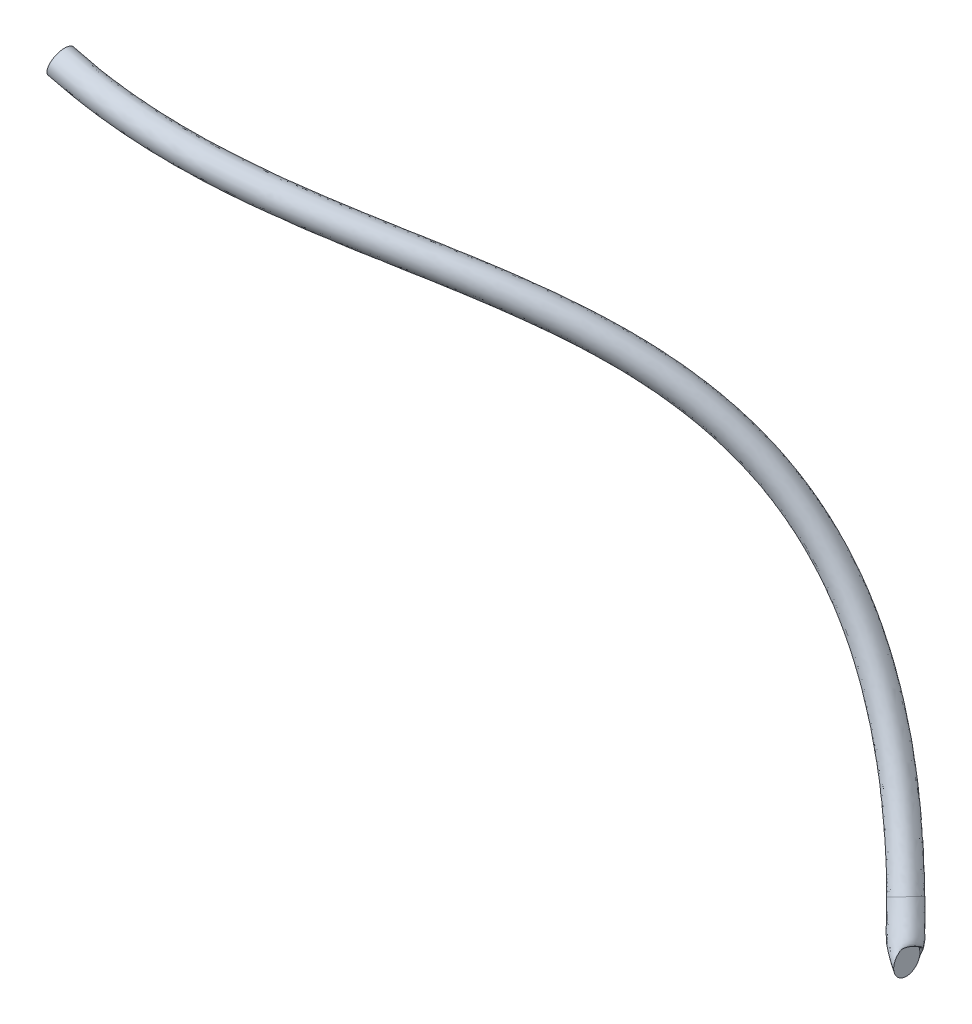
ISO-10303-21;
HEADER;
FILE_DESCRIPTION(('STEP AP214'),'2;1');
FILE_NAME('part.step','',(''),(''),'','','');
FILE_SCHEMA(('AUTOMOTIVE_DESIGN { 1 0 10303 214 1 1 1 1 }'));
ENDSEC;
DATA;
#1=APPLICATION_CONTEXT('core data for automotive mechanical design processes');
#2=APPLICATION_PROTOCOL_DEFINITION('international standard','automotive_design',2000,#1);
#3=PRODUCT_CONTEXT('',#1,'mechanical');
#4=PRODUCT('Part','Part','',(#3));
#5=PRODUCT_RELATED_PRODUCT_CATEGORY('part','',(#4));
#6=PRODUCT_DEFINITION_FORMATION('','',#4);
#7=PRODUCT_DEFINITION_CONTEXT('part definition',#1,'design');
#8=PRODUCT_DEFINITION('design','',#6,#7);
#9=PRODUCT_DEFINITION_SHAPE('','',#8);
#10=(LENGTH_UNIT() NAMED_UNIT(*) SI_UNIT(.MILLI.,.METRE.));
#11=(NAMED_UNIT(*) PLANE_ANGLE_UNIT() SI_UNIT($,.RADIAN.));
#12=(NAMED_UNIT(*) SI_UNIT($,.STERADIAN.) SOLID_ANGLE_UNIT());
#13=UNCERTAINTY_MEASURE_WITH_UNIT(LENGTH_MEASURE(1.E-05),#10,'distance_accuracy_value','');
#14=(GEOMETRIC_REPRESENTATION_CONTEXT(3) GLOBAL_UNCERTAINTY_ASSIGNED_CONTEXT((#13)) GLOBAL_UNIT_ASSIGNED_CONTEXT((#10,
#11,#12)) REPRESENTATION_CONTEXT('',''));
#15=CARTESIAN_POINT('',(0.,0.,0.));
#16=DIRECTION('',(0.,0.,1.));
#17=DIRECTION('',(1.,0.,0.));
#18=AXIS2_PLACEMENT_3D('',#15,#16,#17);
#19=CARTESIAN_POINT('',(446.882833283141,-59.1387044595043,37.8558931334681));
#20=DIRECTION('',(0.999655289938559,0.,-0.0262545481365729));
#21=DIRECTION('',(-0.0172478279121298,0.753937382114558,-0.65671983088876));
#22=AXIS2_PLACEMENT_3D('',#19,#20,#21);
#23=PLANE('',#22);
#24=CARTESIAN_POINT('',(446.839023800244,-57.2237035089334,36.1878247630106));
#25=CARTESIAN_POINT('',(446.825861185545,-57.66055337367,35.6866515055532));
#26=CARTESIAN_POINT('',(446.817501107649,-58.301098772051,35.3683372824512));
#27=CARTESIAN_POINT('',(446.815106393101,-59.6279081963031,35.2771573065552));
#28=CARTESIAN_POINT('',(446.8210865027,-60.3060019516946,35.5048530247995));
#29=CARTESIAN_POINT('',(446.844025094304,-61.3086941046831,36.3782515811853));
#30=CARTESIAN_POINT('',(446.8608423243,-61.6271180917372,37.0185761771227));
#31=CARTESIAN_POINT('',(446.895677106197,-61.7183295091265,38.3449282368166));
#32=CARTESIAN_POINT('',(446.913480151339,-61.4905552748118,39.022788246468));
#33=CARTESIAN_POINT('',(446.939805380736,-60.6168555453387,40.0251347613829));
#34=CARTESIAN_POINT('',(446.948165458632,-59.9763101469576,40.3434489844849));
#35=CARTESIAN_POINT('',(446.95056017318,-58.6495007227055,40.434628960381));
#36=CARTESIAN_POINT('',(446.944580063581,-57.971406967314,40.2069332421366));
#37=CARTESIAN_POINT('',(446.921641471977,-56.9687148143255,39.3335346857509));
#38=CARTESIAN_POINT('',(446.904824241981,-56.6502908272714,38.6932100898134));
#39=CARTESIAN_POINT('',(446.869989460084,-56.5590794098821,37.3668580301195));
#40=CARTESIAN_POINT('',(446.852186414942,-56.7868536441968,36.6889980204681));
#41=CARTESIAN_POINT('',(446.839023800244,-57.2237035089334,36.1878247630106));
#42=B_SPLINE_CURVE_WITH_KNOTS('',3,(#24,#25,#26,#27,#28,#29,#30,#31,#32,#33,#34,#35,#36,#37,#38,
#39,#40,#41),.UNSPECIFIED.,.T.,.F.,(4,2,2,2,2,2,2,2,4),(0.,0.125,0.25,0.375,0.5,0.625,0.75,
0.875,1.),.UNSPECIFIED.);
#43=CARTESIAN_POINT('',(446.839023800244,-57.2237035089334,36.1878247630106));
#44=VERTEX_POINT('',#43);
#45=EDGE_CURVE('E55',#44,#44,#42,.T.);
#46=ORIENTED_EDGE('',*,*,#45,.F.);
#47=EDGE_LOOP('',(#46));
#48=FACE_BOUND('',#47,.T.);
#49=ADVANCED_FACE('F41',(#48),#23,.T.);
#50=CARTESIAN_POINT('',(321.343126633635,41.8502568807353,71.7549999999999));
#51=DIRECTION('',(0.963586759353853,-0.267357445606727,-0.00453359422391789));
#52=DIRECTION('',(0.267360193211581,0.963596662035453,0.));
#53=AXIS2_PLACEMENT_3D('',#50,#51,#52);
#54=PLANE('',#53);
#55=CARTESIAN_POINT('',(322.022221524392,44.2977924023053,71.7549999999999));
#56=CARTESIAN_POINT('',(322.025126485193,44.2969863898816,72.4199636112474));
#57=CARTESIAN_POINT('',(321.954825398612,44.032406859063,73.0808324878151));
#58=CARTESIAN_POINT('',(321.707505374947,43.1250908345853,74.0212330453259));
#59=CARTESIAN_POINT('',(321.532009393196,42.4879414412247,74.2949738969506));
#60=CARTESIAN_POINT('',(321.17643613988,41.2064148388973,74.2949738969506));
#61=CARTESIAN_POINT('',(320.998548428928,40.5699290563677,74.0212330453259));
#62=CARTESIAN_POINT('',(320.743011935337,39.664892779292,73.0808324878151));
#63=CARTESIAN_POINT('',(320.666936703679,39.4019153467415,72.4199636112474));
#64=CARTESIAN_POINT('',(320.661126782076,39.4035273715889,71.0900363887525));
#65=CARTESIAN_POINT('',(320.731427868658,39.6681069024075,70.4291675121847));
#66=CARTESIAN_POINT('',(320.978747892323,40.5754229268852,69.4887669546739));
#67=CARTESIAN_POINT('',(321.154243874074,41.2125723202458,69.2150261030493));
#68=CARTESIAN_POINT('',(321.509817127389,42.4940989225732,69.2150261030493));
#69=CARTESIAN_POINT('',(321.687704838342,43.1305847051028,69.4887669546739));
#70=CARTESIAN_POINT('',(321.943241331933,44.0356209821785,70.4291675121847));
#71=CARTESIAN_POINT('',(322.019316563591,44.298598414729,71.0900363887525));
#72=CARTESIAN_POINT('',(322.022221524392,44.2977924023053,71.7549999999999));
#73=B_SPLINE_CURVE_WITH_KNOTS('',3,(#55,#56,#57,#58,#59,#60,#61,#62,#63,#64,#65,#66,#67,#68,#69,
#70,#71,#72),.UNSPECIFIED.,.T.,.F.,(4,2,2,2,2,2,2,2,4),(0.,0.125,0.25,0.375,0.5,0.625,0.75,
0.875,1.),.UNSPECIFIED.);
#74=CARTESIAN_POINT('',(322.022221524392,44.2977924023053,71.7549999999999));
#75=VERTEX_POINT('',#74);
#76=EDGE_CURVE('E11',#75,#75,#73,.T.);
#77=ORIENTED_EDGE('',*,*,#76,.F.);
#78=EDGE_LOOP('',(#77));
#79=FACE_BOUND('',#78,.T.);
#80=ADVANCED_FACE('F92',(#79),#54,.F.);
#81=CARTESIAN_POINT('',(445.388070627803,-51.5581880827869,33.6142165685252));
#82=CARTESIAN_POINT('',(446.409694618406,-53.605028329331,34.6008385665057));
#83=CARTESIAN_POINT('',(448.808046460333,-57.3841104586074,36.7736312534867));
#84=CARTESIAN_POINT('',(447.49536468694,-57.277172492158,36.3830935931693));
#85=CARTESIAN_POINT('',(446.839023800244,-57.2237035089334,36.1878247630106));
#86=CARTESIAN_POINT('',(445.438117545638,-51.2501665909006,34.2014166489073));
#87=CARTESIAN_POINT('',(446.453808571375,-53.2851193591633,35.1823027566335));
#88=CARTESIAN_POINT('',(448.844488241244,-57.0661308933484,37.3608875447556));
#89=CARTESIAN_POINT('',(447.516287023709,-56.8799460605806,36.9129611952306));
#90=CARTESIAN_POINT('',(446.852186414942,-56.7868536441968,36.6889980204681));
#91=CARTESIAN_POINT('',(445.239039817229,-51.03501052086,34.8539259513364));
#92=CARTESIAN_POINT('',(446.248445221948,-53.057368088204,35.8287345183695));
#93=CARTESIAN_POINT('',(448.563889640348,-56.8164716510782,37.9863324091213));
#94=CARTESIAN_POINT('',(447.434622853506,-56.6448768236141,37.5733494897867));
#95=CARTESIAN_POINT('',(446.869989460084,-56.5590794098821,37.3668580301195));
#96=CARTESIAN_POINT('',(444.455040727101,-50.9119132301119,35.9211353572288));
#97=CARTESIAN_POINT('',(445.454718640467,-52.9147766039813,36.8865371159668));
#98=CARTESIAN_POINT('',(447.527046628681,-56.5947594138857,38.9604530892508));
#99=CARTESIAN_POINT('',(447.112231704215,-56.6317803561429,38.7822910896259));
#100=CARTESIAN_POINT('',(446.904824241981,-56.6502908272714,38.6932100898134));
#101=CARTESIAN_POINT('',(443.87494710063,-51.0047300219216,36.3292637636988));
#102=CARTESIAN_POINT('',(444.871243043899,-53.0008144453522,37.2913941803813));
#103=CARTESIAN_POINT('',(446.777186923741,-56.6240716857745,39.3031304328234));
#104=CARTESIAN_POINT('',(446.873489955898,-56.8538337714752,39.323399934775));
#105=CARTESIAN_POINT('',(446.921641471977,-56.9687148143255,39.3335346857509));
#106=CARTESIAN_POINT('',(442.666111118812,-51.4466871476223,36.6641256186391));
#107=CARTESIAN_POINT('',(443.66051624166,-53.4389775749044,37.6244245799708));
#108=CARTESIAN_POINT('',(445.237985912748,-56.9464823634744,39.5062325275087));
#109=CARTESIAN_POINT('',(446.375715346637,-57.6297654327009,39.9733663372606));
#110=CARTESIAN_POINT('',(446.944580063581,-57.9714069673141,40.2069332421366));
#111=CARTESIAN_POINT('',(442.044812573227,-51.7931059834631,36.5887970438294));
#112=CARTESIAN_POINT('',(443.040720488983,-53.7884047278838,37.5505471695569));
#113=CARTESIAN_POINT('',(444.45812274909,-57.2375954182453,39.3654066099402));
#114=CARTESIAN_POINT('',(446.119747698483,-58.1788656212188,40.0782215102341));
#115=CARTESIAN_POINT('',(446.95056017318,-58.6495007227056,40.434628960381));
#116=CARTESIAN_POINT('',(441.119259423181,-52.5412250353648,35.995153814716));
#117=CARTESIAN_POINT('',(442.122220806419,-54.5506524524437,36.9637206797245));
#118=CARTESIAN_POINT('',(443.31820681579,-57.9152652084997,38.6785156666687));
#119=CARTESIAN_POINT('',(445.738179244351,-59.2892951674717,39.7884712118795));
#120=CARTESIAN_POINT('',(446.948165458632,-59.9763101469576,40.3434489844849));
#121=CARTESIAN_POINT('',(440.820704220194,-52.9383184594578,35.4804947161133));
#122=CARTESIAN_POINT('',(441.829172843802,-54.9587792299642,36.4543851795958));
#123=CARTESIAN_POINT('',(442.965173457825,-58.2976489668156,38.1366804005169));
#124=CARTESIAN_POINT('',(445.614928073099,-59.843786685831,39.3956499744276));
#125=CARTESIAN_POINT('',(446.939805380736,-60.6168555453387,40.025134761383));
#126=CARTESIAN_POINT('',(440.720610384524,-53.5543614432286,34.3060945553473));
#127=CARTESIAN_POINT('',(441.74094493787,-55.5985971703322,35.2914567993718));
#128=CARTESIAN_POINT('',(442.892289896002,-58.9336080973214,36.9621678179655));
#129=CARTESIAN_POINT('',(445.57308339956,-60.6382395489818,38.3359147703006));
#130=CARTESIAN_POINT('',(446.913480151339,-61.4905552748119,39.0227882464681));
#131=CARTESIAN_POINT('',(440.919688112937,-53.7695175132709,33.65358525292));
#132=CARTESIAN_POINT('',(441.946308287235,-55.8263484412597,34.6450250376037));
#133=CARTESIAN_POINT('',(443.172888496925,-59.1832673396035,36.3367229536136));
#134=CARTESIAN_POINT('',(445.654747569773,-60.8733087859522,37.675526475749));
#135=CARTESIAN_POINT('',(446.895677106197,-61.7183295091266,38.3449282368167));
#136=CARTESIAN_POINT('',(441.703687203064,-53.8926148040207,32.5863758470259));
#137=CARTESIAN_POINT('',(442.740034868713,-55.9689399254508,33.5872224400377));
#138=CARTESIAN_POINT('',(444.209731508592,-59.4049795768104,35.3626022734724));
#139=CARTESIAN_POINT('',(445.977138719064,-60.8864052534283,36.466584875906));
#140=CARTESIAN_POINT('',(446.8608423243,-61.6271180917373,37.0185761771227));
#141=CARTESIAN_POINT('',(442.283780829535,-53.7997980122076,32.1782474405559));
#142=CARTESIAN_POINT('',(443.323510465284,-55.8829020841437,33.1823653756237));
#143=CARTESIAN_POINT('',(444.959591213535,-59.3756673048942,35.0199249298987));
#144=CARTESIAN_POINT('',(446.215880467381,-60.6643518380869,35.9254760307564));
#145=CARTESIAN_POINT('',(446.844025094304,-61.3086941046831,36.3782515811853));
#146=CARTESIAN_POINT('',(443.492616811354,-53.3578408865069,31.8433855856156));
#147=CARTESIAN_POINT('',(444.534237267516,-55.4447389545903,32.8493349760334));
#148=CARTESIAN_POINT('',(446.498792224529,-59.053256627194,34.8168228352129));
#149=CARTESIAN_POINT('',(446.713655076643,-59.8884201768611,35.2755096282707));
#150=CARTESIAN_POINT('',(446.8210865027,-60.3060019516946,35.5048530247995));
#151=CARTESIAN_POINT('',(444.113915356942,-53.0114220506695,31.9187141604269));
#152=CARTESIAN_POINT('',(445.154033020135,-55.0953118015491,32.9232123864163));
#153=CARTESIAN_POINT('',(447.278655388209,-58.7621435724495,34.9576487527955));
#154=CARTESIAN_POINT('',(446.969622724804,-59.3393199883519,35.1706544553019));
#155=CARTESIAN_POINT('',(446.815106393101,-59.6279081963031,35.2771573065552));
#156=CARTESIAN_POINT('',(445.039468506984,-52.2633029987644,32.5123573895404));
#157=CARTESIAN_POINT('',(446.072532702764,-54.333064077051,33.5100388762491));
#158=CARTESIAN_POINT('',(448.418571321481,-58.0844737821688,35.644539696066));
#159=CARTESIAN_POINT('',(447.351191178927,-58.2288904420903,35.4604047536561));
#160=CARTESIAN_POINT('',(446.817501107649,-58.301098772051,35.3683372824512));
#161=CARTESIAN_POINT('',(445.338023709968,-51.8662095746731,33.027016488143));
#162=CARTESIAN_POINT('',(446.365580665438,-53.9249372994988,34.0193743763779));
#163=CARTESIAN_POINT('',(448.771604679422,-57.7020900238663,36.1863749622177));
#164=CARTESIAN_POINT('',(447.474442350171,-57.6743989237354,35.853225991108));
#165=CARTESIAN_POINT('',(446.825861185545,-57.66055337367,35.6866515055532));
#166=CARTESIAN_POINT('',(445.388070627803,-51.5581880827869,33.6142165685252));
#167=CARTESIAN_POINT('',(446.409694618406,-53.605028329331,34.6008385665057));
#168=CARTESIAN_POINT('',(448.808046460333,-57.3841104586074,36.7736312534867));
#169=CARTESIAN_POINT('',(447.49536468694,-57.277172492158,36.3830935931693));
#170=CARTESIAN_POINT('',(446.839023800244,-57.2237035089334,36.1878247630106));
#171=B_SPLINE_SURFACE_WITH_KNOTS('',3,3,((#81,#82,#83,#84,#85),(#86,#87,#88,#89,#90),(#91,#92,
#93,#94,#95),(#96,#97,#98,#99,#100),(#101,#102,#103,#104,#105),(#106,#107,#108,#109,#110),(#111,
#112,#113,#114,#115),(#116,#117,#118,#119,#120),(#121,#122,#123,#124,#125),(#126,#127,#128,#129,
#130),(#131,#132,#133,#134,#135),(#136,#137,#138,#139,#140),(#141,#142,#143,#144,#145),(#146,
#147,#148,#149,#150),(#151,#152,#153,#154,#155),(#156,#157,#158,#159,#160),(#161,#162,#163,#164,
#165),(#166,#167,#168,#169,#170)),.UNSPECIFIED.,.T.,.F.,.F.,(4,2,2,2,2,2,2,2,4),(4,1,4),(0.,
0.125,0.25,0.375,0.5,0.625,0.75,0.875,1.),(0.873939984041514,0.936969992020757,1.),.UNSPECIFIED.);
#172=CARTESIAN_POINT('',(445.388070627803,-51.5581880827869,33.6142165685252));
#173=CARTESIAN_POINT('',(445.438117545638,-51.2501665909006,34.2014166489073));
#174=CARTESIAN_POINT('',(445.239039817229,-51.03501052086,34.8539259513364));
#175=CARTESIAN_POINT('',(444.455040727101,-50.9119132301119,35.9211353572288));
#176=CARTESIAN_POINT('',(443.87494710063,-51.0047300219216,36.3292637636988));
#177=CARTESIAN_POINT('',(442.666111118812,-51.4466871476223,36.6641256186391));
#178=CARTESIAN_POINT('',(442.044812573227,-51.7931059834631,36.5887970438294));
#179=CARTESIAN_POINT('',(441.119259423181,-52.5412250353648,35.995153814716));
#180=CARTESIAN_POINT('',(440.820704220194,-52.9383184594578,35.4804947161133));
#181=CARTESIAN_POINT('',(440.720610384524,-53.5543614432286,34.3060945553473));
#182=CARTESIAN_POINT('',(440.919688112937,-53.7695175132709,33.65358525292));
#183=CARTESIAN_POINT('',(441.703687203064,-53.8926148040207,32.5863758470259));
#184=CARTESIAN_POINT('',(442.283780829535,-53.7997980122076,32.1782474405559));
#185=CARTESIAN_POINT('',(443.492616811354,-53.3578408865069,31.8433855856156));
#186=CARTESIAN_POINT('',(444.113915356942,-53.0114220506695,31.9187141604269));
#187=CARTESIAN_POINT('',(445.039468506984,-52.2633029987644,32.5123573895404));
#188=CARTESIAN_POINT('',(445.338023709968,-51.8662095746731,33.027016488143));
#189=CARTESIAN_POINT('',(445.388070627803,-51.5581880827869,33.6142165685252));
#190=B_SPLINE_CURVE_WITH_KNOTS('',3,(#172,#173,#174,#175,#176,#177,#178,#179,#180,#181,#182,
#183,#184,#185,#186,#187,#188,#189),.UNSPECIFIED.,.T.,.F.,(4,2,2,2,2,2,2,2,4),(0.,0.125,0.25,
0.375,0.5,0.625,0.75,0.875,1.),.UNSPECIFIED.);
#191=CARTESIAN_POINT('',(445.388070627803,-51.5581880827869,33.6142165685252));
#192=VERTEX_POINT('',#191);
#193=EDGE_CURVE('E50',#192,#192,#190,.F.);
#194=ORIENTED_EDGE('',*,*,#193,.F.);
#195=EDGE_LOOP('',(#194));
#196=FACE_BOUND('',#195,.T.);
#197=ORIENTED_EDGE('',*,*,#45,.T.);
#198=EDGE_LOOP('',(#197));
#199=FACE_BOUND('',#198,.T.);
#200=ADVANCED_FACE('F82',(#196,#199),#171,.T.);
#201=CARTESIAN_POINT('',(322.022221524392,44.2977924023053,71.7549999999999));
#202=CARTESIAN_POINT('',(333.858130565664,41.0137929312451,71.6993130480867));
#203=CARTESIAN_POINT('',(344.10605537458,38.4095766905013,68.9874518696744));
#204=CARTESIAN_POINT('',(362.357178624235,33.1114097429026,61.3025007930272));
#205=CARTESIAN_POINT('',(370.345247866831,30.4216968132976,56.3366068864337));
#206=CARTESIAN_POINT('',(384.770765735696,24.0327914770682,46.4480762308832));
#207=CARTESIAN_POINT('',(391.192549344173,20.3401767240634,41.536844367466));
#208=CARTESIAN_POINT('',(402.966545383684,11.5686011507622,33.2915607121402));
#209=CARTESIAN_POINT('',(408.301798484552,6.50004393129425,29.9718467018943));
#210=CARTESIAN_POINT('',(418.130057271188,-4.7852911096157,25.6492467920898));
#211=CARTESIAN_POINT('',(422.605187114536,-10.980057332351,24.6542537768065));
#212=CARTESIAN_POINT('',(430.740912862645,-23.6811320080987,24.8170264793377));
#213=CARTESIAN_POINT('',(434.392680775731,-30.1718035330032,25.9718328602735));
#214=CARTESIAN_POINT('',(440.710146339521,-42.0977266022566,29.4057435685164));
#215=CARTESIAN_POINT('',(443.379185254766,-47.5333536328889,31.6741578789412));
#216=CARTESIAN_POINT('',(445.388070627803,-51.5581880827869,33.6142165685252));
#217=CARTESIAN_POINT('',(322.025126485193,44.2969863898816,72.4199636112474));
#218=CARTESIAN_POINT('',(333.954932950638,40.986934074743,72.363834879729));
#219=CARTESIAN_POINT('',(344.290783424645,38.360038714269,69.6273974952142));
#220=CARTESIAN_POINT('',(362.65343715515,33.0294952750193,61.8954845794167));
#221=CARTESIAN_POINT('',(370.675258086575,30.3269755931414,56.906267341838));
#222=CARTESIAN_POINT('',(385.123025800144,23.9282160256426,47.0024846643606));
#223=CARTESIAN_POINT('',(391.54199187312,20.234879604134,42.0933516601516));
#224=CARTESIAN_POINT('',(403.278667178449,11.4911077989782,33.874203567586));
#225=CARTESIAN_POINT('',(408.587245252225,6.44594736918836,30.572307558094));
#226=CARTESIAN_POINT('',(418.349042894138,-4.76307342604976,26.2789381505933));
#227=CARTESIAN_POINT('',(422.793001080649,-10.9148551216161,25.2910408903523));
#228=CARTESIAN_POINT('',(430.871265580261,-23.5262242740913,25.4526639586604));
#229=CARTESIAN_POINT('',(434.502455540765,-29.9798250527724,26.6002495653549));
#230=CARTESIAN_POINT('',(440.783467064028,-41.8369312794941,30.0143453811053));
#231=CARTESIAN_POINT('',(443.440898545406,-47.2487072589148,32.2726368115618));
#232=CARTESIAN_POINT('',(445.438117545638,-51.2501665909006,34.2014166489073));
#233=CARTESIAN_POINT('',(321.954825398612,44.032406859063,73.0808324878151));
#234=CARTESIAN_POINT('',(333.981380341753,40.6955106444009,73.0242485629507));
#235=CARTESIAN_POINT('',(344.404172352,38.046145194901,70.2625716965397));
#236=CARTESIAN_POINT('',(362.866608574354,32.6866356189136,62.4886436301993));
#237=CARTESIAN_POINT('',(370.913563928954,29.9739124112815,57.480940543088));
#238=CARTESIAN_POINT('',(385.360441310177,23.5755471454816,47.5777681680217));
#239=CARTESIAN_POINT('',(391.763701717472,19.8884480958269,42.6805665035348));
#240=CARTESIAN_POINT('',(403.433324683804,11.1946299731611,34.5083748948489));
#241=CARTESIAN_POINT('',(408.700163811336,6.18696756030613,31.2337783931416));
#242=CARTESIAN_POINT('',(418.36691921584,-4.91292064501814,26.9822098305009));
#243=CARTESIAN_POINT('',(422.768062062728,-11.0053117894645,26.0036731026914));
#244=CARTESIAN_POINT('',(430.770380787411,-23.4981183322034,26.1637767119979));
#245=CARTESIAN_POINT('',(434.375068201263,-29.9038231178006,27.3018195701947));
#246=CARTESIAN_POINT('',(440.610798296612,-41.675448425656,30.6913022929796));
#247=CARTESIAN_POINT('',(443.254180640413,-47.0583179476113,32.9370967755983));
#248=CARTESIAN_POINT('',(445.239039817229,-51.03501052086,34.8539259513364));
#249=CARTESIAN_POINT('',(321.707505374947,43.1250908345853,74.0212330453259));
#250=CARTESIAN_POINT('',(333.878632093527,39.748081635789,73.963968922311));
#251=CARTESIAN_POINT('',(344.424248941552,37.0668814008345,71.1647375611932));
#252=CARTESIAN_POINT('',(363.006413782171,31.6726154689747,63.3403956693331));
#253=CARTESIAN_POINT('',(371.072211751032,28.9504529002581,58.3158335484087));
#254=CARTESIAN_POINT('',(385.471530822968,22.5731506687084,48.4452618316666));
#255=CARTESIAN_POINT('',(391.826471560393,18.9089226234449,43.5848509911881));
#256=CARTESIAN_POINT('',(403.34038653676,10.3311062460771,35.5217010573432));
#257=CARTESIAN_POINT('',(408.517187077336,5.40546974083602,32.3052524092541));
#258=CARTESIAN_POINT('',(417.990359714577,-5.47213635083107,28.1388241268967));
#259=CARTESIAN_POINT('',(422.306759426822,-11.4464681515144,27.178252761969));
#260=CARTESIAN_POINT('',(430.163098964744,-23.7113795473653,27.3354357390685));
#261=CARTESIAN_POINT('',(433.717896282264,-30.0266854643918,28.4551372931596));
#262=CARTESIAN_POINT('',(439.870976093486,-41.642286044952,31.799694769068));
#263=CARTESIAN_POINT('',(442.489309346105,-46.9735533511718,34.0228033974571));
#264=CARTESIAN_POINT('',(444.455040727101,-50.9119132301119,35.9211353572288));
#265=CARTESIAN_POINT('',(321.532009393196,42.4879414412247,74.2949738969506));
#266=CARTESIAN_POINT('',(333.750069160216,39.0979101662789,74.2374889583299));
#267=CARTESIAN_POINT('',(344.330812975899,36.4075412687083,71.4261738379711));
#268=CARTESIAN_POINT('',(362.932186673271,31.0076991416502,63.5937437111866));
#269=CARTESIAN_POINT('',(370.991576803991,28.2863588635857,58.5709122211647));
#270=CARTESIAN_POINT('',(385.344520755081,21.9295956618833,48.7321301106413));
#271=CARTESIAN_POINT('',(391.667145032611,18.2818604132859,43.896352202483));
#272=CARTESIAN_POINT('',(403.093363182085,9.76937777955059,35.8946159999534));
#273=CARTESIAN_POINT('',(408.222418524539,4.88776406302513,32.708657632463));
#274=CARTESIAN_POINT('',(417.598242681832,-5.87806128084453,28.5850445061379));
#275=CARTESIAN_POINT('',(421.873236433044,-11.7944512787668,27.6329673438458));
#276=CARTESIAN_POINT('',(429.660441475058,-23.9514334773975,27.7887671325229));
#277=CARTESIAN_POINT('',(433.192158458086,-30.2247931800286,28.899783073624));
#278=CARTESIAN_POINT('',(439.308378358571,-41.7708107266265,32.2243050378861));
#279=CARTESIAN_POINT('',(441.91586590632,-47.0797000319685,34.4373644555348));
#280=CARTESIAN_POINT('',(443.87494710063,-51.0047300219216,36.3292637636988));
#281=CARTESIAN_POINT('',(321.17643613988,41.2064148388973,74.2949738969506));
#282=CARTESIAN_POINT('',(333.411156423815,37.8117609254,74.2374105719019));
#283=CARTESIAN_POINT('',(343.989749461215,35.1217290824913,71.4221377882326));
#284=CARTESIAN_POINT('',(362.537384032212,29.7374870288253,63.6123354238914));
#285=CARTESIAN_POINT('',(370.555918266539,27.028410982796,58.6123083218635));
#286=CARTESIAN_POINT('',(384.797104921401,20.7211438724801,48.8501345478333));
#287=CARTESIAN_POINT('',(391.057029937936,17.1071964454088,44.0621890033592));
#288=CARTESIAN_POINT('',(402.337685204492,8.70315751684875,36.1623898916039));
#289=CARTESIAN_POINT('',(407.392756809457,3.89075237168696,33.0230290051294));
#290=CARTESIAN_POINT('',(416.627735883119,-6.71334708313887,28.9613614137791));
#291=CARTESIAN_POINT('',(420.84522805668,-12.5487450106414,28.0204996008739));
#292=CARTESIAN_POINT('',(428.540909850108,-24.5628458481557,28.1744682605557));
#293=CARTESIAN_POINT('',(432.043227487523,-30.7825037371075,29.2739872289386));
#294=CARTESIAN_POINT('',(438.115470315987,-42.2455026838341,32.574605084889));
#295=CARTESIAN_POINT('',(440.710747967066,-47.5291175378469,34.7758276196649));
#296=CARTESIAN_POINT('',(442.666111118812,-51.4466871476223,36.6641256186391));
#297=CARTESIAN_POINT('',(320.998548428928,40.5699290563677,74.0212330453259));
#298=CARTESIAN_POINT('',(333.202893588311,37.1837030459823,73.9638126325242));
#299=CARTESIAN_POINT('',(343.74422212475,34.5031748447483,71.1566903150145));
#300=CARTESIAN_POINT('',(362.219239628174,29.1400129970266,63.3774646101068));
#301=CARTESIAN_POINT('',(370.203577388654,26.4423033713266,58.3983708394253));
#302=CARTESIAN_POINT('',(384.380070050605,20.163688533832,48.6805440545848));
#303=CARTESIAN_POINT('',(390.60999835771,16.5668280717195,43.9155033979253));
#304=CARTESIAN_POINT('',(401.833683920171,8.20523132687079,36.0555999335514));
#305=CARTESIAN_POINT('',(406.862972565536,3.41758578954061,32.9320593081654));
#306=CARTESIAN_POINT('',(416.055322335355,-7.13756440535014,28.8891406457123));
#307=CARTESIAN_POINT('',(420.257072977667,-12.9504108007271,27.9509309172983));
#308=CARTESIAN_POINT('',(427.930929603348,-24.9304393136997,28.1044629120263));
#309=CARTESIAN_POINT('',(431.427109266024,-31.1386722905953,29.20124131734));
#310=CARTESIAN_POINT('',(437.492505736324,-42.5887468853469,32.4981377738443));
#311=CARTESIAN_POINT('',(440.086494382531,-47.8696209249971,34.6976455263832));
#312=CARTESIAN_POINT('',(442.044812573227,-51.7931059834631,36.5887970438294));
#313=CARTESIAN_POINT('',(320.743011935337,39.664892779292,73.0808324878151));
#314=CARTESIAN_POINT('',(332.826346848374,36.3122423554018,73.0239814182309));
#315=CARTESIAN_POINT('',(343.241808887114,33.6640256063377,70.2488166141615));
#316=CARTESIAN_POINT('',(361.521099170898,28.3576819499825,62.5520052231489));
#317=CARTESIAN_POINT('',(369.428815353448,25.6867559285596,57.6220207607734));
#318=CARTESIAN_POINT('',(383.494817642464,19.4570761005761,47.9799338668058));
#319=CARTESIAN_POINT('',(389.684395472924,15.885127829457,43.2457475636191));
#320=CARTESIAN_POINT('',(400.857932022882,7.56089189800658,35.4209632398714));
#321=CARTESIAN_POINT('',(405.872630450486,2.78909615355382,32.3051735508566));
#322=CARTESIAN_POINT('',(415.059377958902,-7.75962120987755,28.2647188238961));
#323=CARTESIAN_POINT('',(419.26455222524,-13.5759868643113,27.3244046318761));
#324=CARTESIAN_POINT('',(426.954954618751,-25.5818457654626,27.4782676511333));
#325=CARTESIAN_POINT('',(430.459447424073,-31.8045317780018,28.5771281860332));
#326=CARTESIAN_POINT('',(436.545301207113,-43.2932250695877,31.8851443750125));
#327=CARTESIAN_POINT('',(439.147071542871,-48.5899578534321,34.0905981016361));
#328=CARTESIAN_POINT('',(441.119259423181,-52.5412250353648,35.995153814716));
#329=CARTESIAN_POINT('',(320.666936703679,39.4019153467415,72.4199636112474));
#330=CARTESIAN_POINT('',(332.660381655687,36.0742058535078,72.3635354662316));
#331=CARTESIAN_POINT('',(342.988016762806,33.4485979464317,69.6119809209002));
#332=CARTESIAN_POINT('',(361.145402149615,28.1776423983243,61.9664996907965));
#333=CARTESIAN_POINT('',(369.011165052435,25.5219686320925,57.0643887986456));
#334=CARTESIAN_POINT('',(383.032051340059,19.3122702070572,47.4532284124372));
#335=CARTESIAN_POINT('',(389.211523876648,15.7479937567743,42.7268015792811));
#336=CARTESIAN_POINT('',(400.392189926311,7.41844639369838,34.8970244906917));
#337=CARTESIAN_POINT('',(405.418170940157,2.63764323390496,31.7731177482804));
#338=CARTESIAN_POINT('',(414.641979989353,-7.95363017060212,27.7163628551256));
#339=CARTESIAN_POINT('',(418.866298328986,-13.796044944965,26.7713050741131));
#340=CARTESIAN_POINT('',(426.594969771203,-25.8616474998165,26.925933744407));
#341=CARTESIAN_POINT('',(430.113862503153,-32.1101224608864,28.0296041506344));
#342=CARTESIAN_POINT('',(436.226893984818,-43.6501209932074,31.3523929979799));
#343=CARTESIAN_POINT('',(438.837687096706,-48.9653556805932,33.5654708668069));
#344=CARTESIAN_POINT('',(440.820704220194,-52.9383184594578,35.4804947161133));
#345=CARTESIAN_POINT('',(320.661126782076,39.4035273715889,71.0900363887525));
#346=CARTESIAN_POINT('',(332.466776885682,36.127923566314,71.03449180252));
#347=CARTESIAN_POINT('',(342.618560662676,33.5476738988962,68.3320896698913));
#348=CARTESIAN_POINT('',(360.552885087787,28.341471334091,60.7805321179467));
#349=CARTESIAN_POINT('',(368.351144612948,25.7114110723094,55.9250678878371));
#350=CARTESIAN_POINT('',(382.327531211163,19.5214211100039,46.3444115454823));
#351=CARTESIAN_POINT('',(388.512638818525,15.958587996576,41.6137869939099));
#352=CARTESIAN_POINT('',(399.76794633701,7.57343309732347,33.7317387797999));
#353=CARTESIAN_POINT('',(404.847277404389,2.74583635801158,30.5721960358283));
#354=CARTESIAN_POINT('',(414.204008743874,-7.9980655376289,26.4569801381712));
#355=CARTESIAN_POINT('',(418.49067039676,-13.9264493665373,25.4977308470471));
#356=CARTESIAN_POINT('',(426.334264335971,-26.1714629677288,25.654658785736));
#357=CARTESIAN_POINT('',(429.894312973083,-32.4940794214436,26.7727707404715));
#358=CARTESIAN_POINT('',(436.080252535805,-44.1717116386374,30.1351893728022));
#359=CARTESIAN_POINT('',(438.714260515426,-49.5346484284728,32.3685130014988));
#360=CARTESIAN_POINT('',(440.720610384524,-53.5543614432286,34.3060945553473));
#361=CARTESIAN_POINT('',(320.731427868658,39.6681069024075,70.4291675121847));
#362=CARTESIAN_POINT('',(332.440329493744,36.4193469959881,70.3740781192877));
#363=CARTESIAN_POINT('',(342.505171736169,33.8615674182642,67.6969154685658));
#364=CARTESIAN_POINT('',(360.339713667734,28.6843309901966,60.1873730671641));
#365=CARTESIAN_POINT('',(368.112838770569,26.0644742541694,55.3503946868417));
#366=CARTESIAN_POINT('',(382.09011570113,19.874089990165,45.7691280415668));
#367=CARTESIAN_POINT('',(388.290928974173,16.3050195048261,41.0265721504126));
#368=CARTESIAN_POINT('',(399.613288831655,7.86991092319758,33.0975674526512));
#369=CARTESIAN_POINT('',(404.734358845277,3.00481616678874,29.9107252007808));
#370=CARTESIAN_POINT('',(414.186132422172,-7.84821831855534,25.7537084582636));
#371=CARTESIAN_POINT('',(418.515609414681,-13.8359926986888,24.7850986347592));
#372=CARTESIAN_POINT('',(426.435149128821,-26.1995689096167,24.9435460323473));
#373=CARTESIAN_POINT('',(430.021700312968,-32.5700813564155,26.0712007355838));
#374=CARTESIAN_POINT('',(436.252921302842,-44.3331944924756,29.4582324609753));
#375=CARTESIAN_POINT('',(438.900978420546,-49.7250377398432,31.7040530375299));
#376=CARTESIAN_POINT('',(440.919688112937,-53.7695175132709,33.65358525292));
#377=CARTESIAN_POINT('',(320.978747892323,40.5754229268852,69.4887669546739));
#378=CARTESIAN_POINT('',(332.543077742511,37.366776005019,69.4343577600198));
#379=CARTESIAN_POINT('',(342.485095146052,34.8408312123307,66.7947496038416));
#380=CARTESIAN_POINT('',(360.199908460483,29.6983511401356,59.335621028101));
#381=CARTESIAN_POINT('',(367.954190947981,27.0879337651927,54.5155016813301));
#382=CARTESIAN_POINT('',(381.979026188849,20.8764864669381,44.9016343781127));
#383=CARTESIAN_POINT('',(388.228159131252,17.2845449772936,40.1222876631586));
#384=CARTESIAN_POINT('',(399.706226978699,8.73343465019602,32.0842412897575));
#385=CARTESIAN_POINT('',(404.917335579698,3.78631398646905,28.8392511847734));
#386=CARTESIAN_POINT('',(414.562691923014,-7.28900261295272,24.5970941617627));
#387=CARTESIAN_POINT('',(418.976912050792,-13.3948363366389,23.6105189754815));
#388=CARTESIAN_POINT('',(427.042430951284,-25.9863076944549,23.7718870052767));
#389=CARTESIAN_POINT('',(430.678872231585,-32.4472190098242,24.9178830126189));
#390=CARTESIAN_POINT('',(436.992743506347,-44.3663568731796,28.349839984887));
#391=CARTESIAN_POINT('',(439.665849714861,-49.8098023363495,30.6183464156044));
#392=CARTESIAN_POINT('',(441.703687203064,-53.8926148040207,32.5863758470259));
#393=CARTESIAN_POINT('',(321.154243874074,41.2125723202458,69.2150261030493));
#394=CARTESIAN_POINT('',(332.671640675778,38.0169474743611,69.1608377242561));
#395=CARTESIAN_POINT('',(342.578531111705,35.5001713444569,66.5333133271344));
#396=CARTESIAN_POINT('',(360.274135569383,30.36326746746,59.0822729861768));
#397=CARTESIAN_POINT('',(368.034825895022,27.7520278018651,54.2604230083195));
#398=CARTESIAN_POINT('',(382.106036256735,21.5200414737632,44.6147660993927));
#399=CARTESIAN_POINT('',(388.387485659034,17.9116071873671,39.8107864517496));
#400=CARTESIAN_POINT('',(399.953250333374,9.2951631168081,31.7113263472615));
#401=CARTESIAN_POINT('',(405.212104132496,4.30401966427997,28.4358459614594));
#402=CARTESIAN_POINT('',(414.954808955759,-6.88307768293924,24.1508737826266));
#403=CARTESIAN_POINT('',(419.410435044365,-13.0468532093865,23.1558043936304));
#404=CARTESIAN_POINT('',(427.545088441175,-25.7462537644226,23.3185556117968));
#405=CARTESIAN_POINT('',(431.204610055954,-32.2491112942832,24.4732372322024));
#406=CARTESIAN_POINT('',(437.555341241072,-44.2378321914101,27.9252297160214));
#407=CARTESIAN_POINT('',(440.239293154644,-49.7036556554175,30.2037853575258));
#408=CARTESIAN_POINT('',(442.283780829535,-53.7997980122076,32.1782474405559));
#409=CARTESIAN_POINT('',(321.509817127389,42.4940989225732,69.2150261030493));
#410=CARTESIAN_POINT('',(333.010553412178,39.30309671524,69.160916110684));
#411=CARTESIAN_POINT('',(342.919594626389,36.7859835306739,66.5373493768022));
#412=CARTESIAN_POINT('',(360.668938210442,31.6334795802849,59.0636812735427));
#413=CARTESIAN_POINT('',(368.470484432729,29.0099756826867,54.2190269078753));
#414=CARTESIAN_POINT('',(382.653452090161,22.7284932631346,44.496761661946));
#415=CARTESIAN_POINT('',(388.997600753709,19.0862711553583,39.6449496506452));
#416=CARTESIAN_POINT('',(400.708928310967,10.3613833793958,31.4435524558391));
#417=CARTESIAN_POINT('',(406.041765847157,5.30103135551301,28.1214745887404));
#418=CARTESIAN_POINT('',(415.925315754893,-6.04779188053977,23.7745568750379));
#419=CARTESIAN_POINT('',(420.43844342073,-12.2925594776144,22.768272136551));
#420=CARTESIAN_POINT('',(428.664620066124,-25.134841393562,22.9328544838151));
#421=CARTESIAN_POINT('',(432.353541026325,-31.6914007370127,24.099033076792));
#422=CARTESIAN_POINT('',(438.748249283846,-43.7631402343924,27.5749296691134));
#423=CARTESIAN_POINT('',(441.4444110939,-49.2542381495423,29.8653221933974));
#424=CARTESIAN_POINT('',(443.492616811354,-53.3578408865069,31.8433855856156));
#425=CARTESIAN_POINT('',(321.687704838342,43.1305847051028,69.4887669546739));
#426=CARTESIAN_POINT('',(333.218816247494,39.9311545947192,69.434514050235));
#427=CARTESIAN_POINT('',(343.165121963137,37.4045377684523,66.8027968499495));
#428=CARTESIAN_POINT('',(360.987082614197,32.2309536120483,59.298552087398));
#429=CARTESIAN_POINT('',(368.822825310614,29.596083294172,54.4329643903135));
#430=CARTESIAN_POINT('',(383.070486960957,23.2859486017668,44.6663521551946));
#431=CARTESIAN_POINT('',(389.444632334391,19.6266395290191,39.7916352563073));
#432=CARTESIAN_POINT('',(401.212929594832,10.8593095694023,31.5503424136635));
#433=CARTESIAN_POINT('',(406.571550091078,5.77419793765935,28.212444285757));
#434=CARTESIAN_POINT('',(416.497729302658,-5.62357455832849,23.8467776430521));
#435=CARTESIAN_POINT('',(421.026598499947,-11.8908936873238,22.8378408201267));
#436=CARTESIAN_POINT('',(429.274600312679,-24.7672479282228,23.0028598323445));
#437=CARTESIAN_POINT('',(432.969659248016,-31.3352321836208,24.1717789884385));
#438=CARTESIAN_POINT('',(439.371213863319,-43.4198960327847,27.6513969801106));
#439=CARTESIAN_POINT('',(442.068664678566,-48.9137347625242,29.943504286745));
#440=CARTESIAN_POINT('',(444.113915356942,-53.0114220506695,31.9187141604269));
#441=CARTESIAN_POINT('',(321.943241331933,44.0356209821785,70.4291675121847));
#442=CARTESIAN_POINT('',(333.595362987406,40.8026152852882,70.3743452644399));
#443=CARTESIAN_POINT('',(343.667535200773,38.2436870067568,67.7106705508732));
#444=CARTESIAN_POINT('',(361.685223071472,33.0132846591985,60.1240114742852));
#445=CARTESIAN_POINT('',(369.59758734582,30.3516307368912,55.2093144689017));
#446=CARTESIAN_POINT('',(383.955739369097,23.9925610350705,45.3669623430372));
#447=CARTESIAN_POINT('',(390.370235218721,20.3083397713386,40.4613910904424));
#448=CARTESIAN_POINT('',(402.188681492576,11.5036489982095,32.1849791075146));
#449=CARTESIAN_POINT('',(407.561892206549,6.40268757354102,28.8393300430657));
#450=CARTESIAN_POINT('',(417.49367367869,-5.00151775369596,24.4711994648684));
#451=CARTESIAN_POINT('',(422.019119251964,-11.265317623842,23.4643671055489));
#452=CARTESIAN_POINT('',(430.250575297687,-24.1158414763575,23.6290550932376));
#453=CARTESIAN_POINT('',(433.937321089967,-30.6693726961185,24.7958921197931));
#454=CARTESIAN_POINT('',(440.31841839253,-42.7154178486388,28.264390378895));
#455=CARTESIAN_POINT('',(443.008087518092,-48.1933978339572,30.5505517114913));
#456=CARTESIAN_POINT('',(445.039468506984,-52.2633029987644,32.5123573895404));
#457=CARTESIAN_POINT('',(322.019316563591,44.298598414729,71.0900363887525));
#458=CARTESIAN_POINT('',(333.76132818069,41.0406517877472,71.0347912164444));
#459=CARTESIAN_POINT('',(343.921327324515,38.4591146667335,68.3475062441346));
#460=CARTESIAN_POINT('',(362.060920093321,33.193324210786,60.7095170066377));
#461=CARTESIAN_POINT('',(370.015237647087,30.5164180334538,55.7669464310295));
#462=CARTESIAN_POINT('',(384.418505671248,24.1373669284938,45.8936677974057));
#463=CARTESIAN_POINT('',(390.843106815225,20.4454738439928,40.9803370747804));
#464=CARTESIAN_POINT('',(402.654423588919,11.6460945025462,32.7089178566943));
#465=CARTESIAN_POINT('',(408.016351716878,6.55414049340014,29.3713858456945));
#466=CARTESIAN_POINT('',(417.911071648239,-4.80750879318165,25.0195554335863));
#467=CARTESIAN_POINT('',(422.417373148423,-11.0452595430859,24.0174666632606));
#468=CARTESIAN_POINT('',(430.61056014503,-23.836039742106,24.181389000015));
#469=CARTESIAN_POINT('',(434.282906010696,-30.3637820132339,25.343416155192));
#470=CARTESIAN_POINT('',(440.636825615015,-42.3585219250191,28.7971417559276));
#471=CARTESIAN_POINT('',(443.317471964127,-47.8180000068629,31.0756789463205));
#472=CARTESIAN_POINT('',(445.338023709968,-51.8662095746731,33.027016488143));
#473=CARTESIAN_POINT('',(322.022221524392,44.2977924023053,71.7549999999999));
#474=CARTESIAN_POINT('',(333.858130565664,41.0137929312451,71.6993130480867));
#475=CARTESIAN_POINT('',(344.10605537458,38.4095766905013,68.9874518696744));
#476=CARTESIAN_POINT('',(362.357178624235,33.1114097429026,61.3025007930272));
#477=CARTESIAN_POINT('',(370.345247866831,30.4216968132976,56.3366068864337));
#478=CARTESIAN_POINT('',(384.770765735696,24.0327914770682,46.4480762308832));
#479=CARTESIAN_POINT('',(391.192549344173,20.3401767240634,41.536844367466));
#480=CARTESIAN_POINT('',(402.966545383684,11.5686011507622,33.2915607121402));
#481=CARTESIAN_POINT('',(408.301798484552,6.50004393129425,29.9718467018943));
#482=CARTESIAN_POINT('',(418.130057271188,-4.7852911096157,25.6492467920898));
#483=CARTESIAN_POINT('',(422.605187114536,-10.980057332351,24.6542537768065));
#484=CARTESIAN_POINT('',(430.740912862645,-23.6811320080987,24.8170264793377));
#485=CARTESIAN_POINT('',(434.392680775731,-30.1718035330032,25.9718328602735));
#486=CARTESIAN_POINT('',(440.710146339521,-42.0977266022566,29.4057435685164));
#487=CARTESIAN_POINT('',(443.379185254766,-47.5333536328889,31.6741578789412));
#488=CARTESIAN_POINT('',(445.388070627803,-51.5581880827869,33.6142165685252));
#489=B_SPLINE_SURFACE_WITH_KNOTS('',3,3,((#201,#202,#203,#204,#205,#206,#207,#208,#209,#210,
#211,#212,#213,#214,#215,#216),(#217,#218,#219,#220,#221,#222,#223,#224,#225,#226,#227,#228,
#229,#230,#231,#232),(#233,#234,#235,#236,#237,#238,#239,#240,#241,#242,#243,#244,#245,#246,
#247,#248),(#249,#250,#251,#252,#253,#254,#255,#256,#257,#258,#259,#260,#261,#262,#263,#264),
(#265,#266,#267,#268,#269,#270,#271,#272,#273,#274,#275,#276,#277,#278,#279,#280),(#281,#282,
#283,#284,#285,#286,#287,#288,#289,#290,#291,#292,#293,#294,#295,#296),(#297,#298,#299,#300,
#301,#302,#303,#304,#305,#306,#307,#308,#309,#310,#311,#312),(#313,#314,#315,#316,#317,#318,
#319,#320,#321,#322,#323,#324,#325,#326,#327,#328),(#329,#330,#331,#332,#333,#334,#335,#336,
#337,#338,#339,#340,#341,#342,#343,#344),(#345,#346,#347,#348,#349,#350,#351,#352,#353,#354,
#355,#356,#357,#358,#359,#360),(#361,#362,#363,#364,#365,#366,#367,#368,#369,#370,#371,#372,
#373,#374,#375,#376),(#377,#378,#379,#380,#381,#382,#383,#384,#385,#386,#387,#388,#389,#390,
#391,#392),(#393,#394,#395,#396,#397,#398,#399,#400,#401,#402,#403,#404,#405,#406,#407,#408),
(#409,#410,#411,#412,#413,#414,#415,#416,#417,#418,#419,#420,#421,#422,#423,#424),(#425,#426,
#427,#428,#429,#430,#431,#432,#433,#434,#435,#436,#437,#438,#439,#440),(#441,#442,#443,#444,
#445,#446,#447,#448,#449,#450,#451,#452,#453,#454,#455,#456),(#457,#458,#459,#460,#461,#462,
#463,#464,#465,#466,#467,#468,#469,#470,#471,#472),(#473,#474,#475,#476,#477,#478,#479,#480,
#481,#482,#483,#484,#485,#486,#487,#488)),.UNSPECIFIED.,.T.,.F.,.F.,(4,2,2,2,2,2,2,2,4),(4,2,2,
2,2,2,2,4),(0.,0.125,0.25,0.375,0.5,0.625,0.75,0.875,1.),(0.,0.125,0.25,0.375,0.5,0.625,0.75,
0.873939984041514),.UNSPECIFIED.);
#490=ORIENTED_EDGE('',*,*,#76,.T.);
#491=EDGE_LOOP('',(#490));
#492=FACE_BOUND('',#491,.T.);
#493=ORIENTED_EDGE('',*,*,#193,.T.);
#494=EDGE_LOOP('',(#493));
#495=FACE_BOUND('',#494,.T.);
#496=ADVANCED_FACE('F71',(#492,#495),#489,.T.);
#497=CLOSED_SHELL('',(#49,#80,#200,#496));
#498=MANIFOLD_SOLID_BREP('B2',#497);
#499=ADVANCED_BREP_SHAPE_REPRESENTATION('',(#18,#498),#14);
#500=SHAPE_DEFINITION_REPRESENTATION(#9,#499);
ENDSEC;
END-ISO-10303-21;
